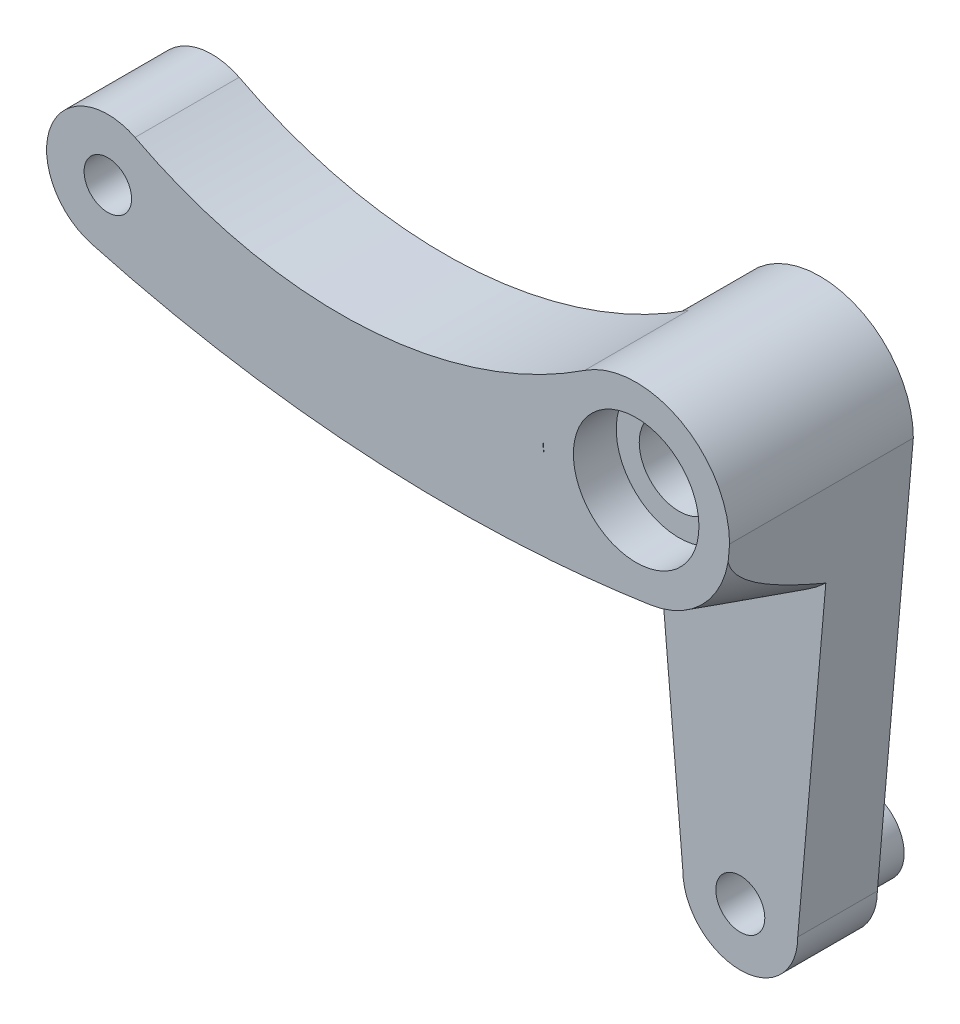
ISO-10303-21;
HEADER;
FILE_DESCRIPTION(('STEP AP214'),'2;1');
FILE_NAME('part.step','',(''),(''),'','','');
FILE_SCHEMA(('AUTOMOTIVE_DESIGN { 1 0 10303 214 1 1 1 1 }'));
ENDSEC;
DATA;
#1=APPLICATION_CONTEXT('core data for automotive mechanical design processes');
#2=APPLICATION_PROTOCOL_DEFINITION('international standard','automotive_design',2000,#1);
#3=PRODUCT_CONTEXT('',#1,'mechanical');
#4=PRODUCT('Part','Part','',(#3));
#5=PRODUCT_RELATED_PRODUCT_CATEGORY('part','',(#4));
#6=PRODUCT_DEFINITION_FORMATION('','',#4);
#7=PRODUCT_DEFINITION_CONTEXT('part definition',#1,'design');
#8=PRODUCT_DEFINITION('design','',#6,#7);
#9=PRODUCT_DEFINITION_SHAPE('','',#8);
#10=(LENGTH_UNIT() NAMED_UNIT(*) SI_UNIT(.MILLI.,.METRE.));
#11=(NAMED_UNIT(*) PLANE_ANGLE_UNIT() SI_UNIT($,.RADIAN.));
#12=(NAMED_UNIT(*) SI_UNIT($,.STERADIAN.) SOLID_ANGLE_UNIT());
#13=UNCERTAINTY_MEASURE_WITH_UNIT(LENGTH_MEASURE(1.E-05),#10,'distance_accuracy_value','');
#14=(GEOMETRIC_REPRESENTATION_CONTEXT(3) GLOBAL_UNCERTAINTY_ASSIGNED_CONTEXT((#13)) GLOBAL_UNIT_ASSIGNED_CONTEXT((#10,
#11,#12)) REPRESENTATION_CONTEXT('',''));
#15=CARTESIAN_POINT('',(0.,0.,0.));
#16=DIRECTION('',(0.,0.,1.));
#17=DIRECTION('',(1.,0.,0.));
#18=AXIS2_PLACEMENT_3D('',#15,#16,#17);
#19=CARTESIAN_POINT('',(0.,0.,12.));
#20=DIRECTION('',(0.,0.,-1.));
#21=DIRECTION('',(-1.,0.,0.));
#22=AXIS2_PLACEMENT_3D('',#19,#20,#21);
#23=CYLINDRICAL_SURFACE('',#22,6.1);
#24=CARTESIAN_POINT('',(0.,0.,5.2));
#25=DIRECTION('',(0.,0.,-1.));
#26=DIRECTION('',(1.,0.,0.));
#27=AXIS2_PLACEMENT_3D('',#24,#25,#26);
#28=CIRCLE('',#27,6.1);
#29=CARTESIAN_POINT('',(-6.1,0.,5.2));
#30=VERTEX_POINT('',#29);
#31=CARTESIAN_POINT('',(-3.36501602680877,5.08789417532638,5.2));
#32=VERTEX_POINT('',#31);
#33=EDGE_CURVE('E280',#30,#32,#28,.T.);
#34=ORIENTED_EDGE('',*,*,#33,.T.);
#35=DIRECTION('',(0.,0.,-1.));
#36=VECTOR('',#35,1.);
#37=CARTESIAN_POINT('',(-3.36501602680877,5.08789417532638,12.));
#38=LINE('',#37,#36);
#39=CARTESIAN_POINT('',(-3.36501602680877,5.08789417532638,12.));
#40=VERTEX_POINT('',#39);
#41=EDGE_CURVE('E154',#40,#32,#38,.T.);
#42=ORIENTED_EDGE('',*,*,#41,.F.);
#43=CARTESIAN_POINT('',(0.,0.,12.));
#44=DIRECTION('',(0.,0.,1.));
#45=DIRECTION('',(1.,0.,0.));
#46=AXIS2_PLACEMENT_3D('',#43,#44,#45);
#47=CIRCLE('',#46,6.1);
#48=CARTESIAN_POINT('',(6.1,0.,12.));
#49=VERTEX_POINT('',#48);
#50=EDGE_CURVE('E141',#49,#40,#47,.T.);
#51=ORIENTED_EDGE('',*,*,#50,.F.);
#52=DIRECTION('',(0.,0.,-1.));
#53=VECTOR('',#52,1.);
#54=CARTESIAN_POINT('',(6.1,0.,12.));
#55=LINE('',#54,#53);
#56=CARTESIAN_POINT('',(6.1,0.,0.));
#57=VERTEX_POINT('',#56);
#58=EDGE_CURVE('E215',#49,#57,#55,.T.);
#59=ORIENTED_EDGE('',*,*,#58,.T.);
#60=CARTESIAN_POINT('',(0.,0.,0.));
#61=DIRECTION('',(0.,0.,1.));
#62=DIRECTION('',(1.,0.,0.));
#63=AXIS2_PLACEMENT_3D('',#60,#61,#62);
#64=CIRCLE('',#63,6.1);
#65=CARTESIAN_POINT('',(-6.1,0.,0.));
#66=VERTEX_POINT('',#65);
#67=EDGE_CURVE('E205',#57,#66,#64,.T.);
#68=ORIENTED_EDGE('',*,*,#67,.T.);
#69=DIRECTION('',(0.,0.,-1.));
#70=VECTOR('',#69,1.);
#71=CARTESIAN_POINT('',(-6.1,0.,12.));
#72=LINE('',#71,#70);
#73=EDGE_CURVE('E211',#30,#66,#72,.T.);
#74=ORIENTED_EDGE('',*,*,#73,.F.);
#75=EDGE_LOOP('',(#34,#42,#51,#59,#68,#74));
#76=FACE_BOUND('',#75,.T.);
#77=ADVANCED_FACE('F35',(#76),#23,.T.);
#78=CARTESIAN_POINT('',(0.,0.,5.2));
#79=DIRECTION('',(0.,0.,1.));
#80=DIRECTION('',(1.,0.,0.));
#81=AXIS2_PLACEMENT_3D('',#78,#79,#80);
#82=PLANE('',#81);
#83=CARTESIAN_POINT('',(0.,-26.8,5.2));
#84=DIRECTION('',(0.,0.,1.));
#85=DIRECTION('',(1.,0.,0.));
#86=AXIS2_PLACEMENT_3D('',#83,#84,#85);
#87=CIRCLE('',#86,1.6);
#88=CARTESIAN_POINT('',(1.6,-26.8,5.2));
#89=VERTEX_POINT('',#88);
#90=EDGE_CURVE('E191',#89,#89,#87,.T.);
#91=ORIENTED_EDGE('',*,*,#90,.F.);
#92=EDGE_LOOP('',(#91));
#93=FACE_BOUND('',#92,.T.);
#94=CARTESIAN_POINT('',(0.,0.,5.2));
#95=DIRECTION('',(0.,0.,1.));
#96=DIRECTION('',(1.,0.,0.));
#97=AXIS2_PLACEMENT_3D('',#94,#95,#96);
#98=CIRCLE('',#97,8.1);
#99=CARTESIAN_POINT('',(5.58562427825305,-5.86607206077372,5.2));
#100=VERTEX_POINT('',#99);
#101=CARTESIAN_POINT('',(1.19677567262764,-8.01110029829902,5.2));
#102=VERTEX_POINT('',#101);
#103=EDGE_CURVE('E230',#100,#102,#98,.F.);
#104=ORIENTED_EDGE('',*,*,#103,.T.);
#105=CARTESIAN_POINT('',(-12.1716520767408,81.4758586867667,5.2));
#106=DIRECTION('',(0.,0.,1.));
#107=DIRECTION('',(1.,0.,0.));
#108=AXIS2_PLACEMENT_3D('',#105,#106,#107);
#109=CIRCLE('',#108,90.4800015964021);
#110=CARTESIAN_POINT('',(-5.33315072148599,-8.74534496347895,5.2));
#111=VERTEX_POINT('',#110);
#112=EDGE_CURVE('E232',#102,#111,#109,.F.);
#113=ORIENTED_EDGE('',*,*,#112,.T.);
#114=DIRECTION('',(0.0873513906763995,-0.996177561756386,0.));
#115=VECTOR('',#114,1.);
#116=CARTESIAN_POINT('',(-6.00691076147216,-1.06161344363656,5.2));
#117=LINE('',#116,#115);
#118=CARTESIAN_POINT('',(-3.75,-26.8,5.2));
#119=VERTEX_POINT('',#118);
#120=EDGE_CURVE('E180',#111,#119,#117,.T.);
#121=ORIENTED_EDGE('',*,*,#120,.T.);
#122=CARTESIAN_POINT('',(0.,-26.8,5.2));
#123=DIRECTION('',(0.,0.,1.));
#124=DIRECTION('',(1.,0.,0.));
#125=AXIS2_PLACEMENT_3D('',#122,#123,#124);
#126=CIRCLE('',#125,3.75);
#127=CARTESIAN_POINT('',(3.75,-26.8,5.2));
#128=VERTEX_POINT('',#127);
#129=EDGE_CURVE('E179',#119,#128,#126,.T.);
#130=ORIENTED_EDGE('',*,*,#129,.T.);
#131=DIRECTION('',(0.0873513906763995,0.996177561756386,0.));
#132=VECTOR('',#131,1.);
#133=CARTESIAN_POINT('',(3.75,-26.8,5.2));
#134=LINE('',#133,#132);
#135=EDGE_CURVE('E182',#128,#100,#134,.T.);
#136=ORIENTED_EDGE('',*,*,#135,.T.);
#137=EDGE_LOOP('',(#104,#113,#121,#130,#136));
#138=FACE_BOUND('',#137,.T.);
#139=ADVANCED_FACE('F269',(#93,#138),#82,.T.);
#140=CARTESIAN_POINT('',(0.,0.,12.));
#141=DIRECTION('',(0.,0.,-1.));
#142=DIRECTION('',(-1.,0.,0.));
#143=AXIS2_PLACEMENT_3D('',#140,#141,#142);
#144=CYLINDRICAL_SURFACE('',#143,2.6);
#145=CARTESIAN_POINT('',(0.,0.,2.8));
#146=DIRECTION('',(0.,0.,-1.));
#147=DIRECTION('',(-1.,0.,0.));
#148=AXIS2_PLACEMENT_3D('',#145,#146,#147);
#149=CIRCLE('',#148,2.6);
#150=CARTESIAN_POINT('',(-2.6,0.,2.8));
#151=VERTEX_POINT('',#150);
#152=EDGE_CURVE('E173',#151,#151,#149,.T.);
#153=ORIENTED_EDGE('',*,*,#152,.T.);
#154=EDGE_LOOP('',(#153));
#155=FACE_BOUND('',#154,.T.);
#156=CARTESIAN_POINT('',(0.,0.,9.2));
#157=DIRECTION('',(0.,0.,1.));
#158=DIRECTION('',(1.,0.,0.));
#159=AXIS2_PLACEMENT_3D('',#156,#157,#158);
#160=CIRCLE('',#159,2.6);
#161=CARTESIAN_POINT('',(2.6,0.,9.2));
#162=VERTEX_POINT('',#161);
#163=EDGE_CURVE('E149',#162,#162,#160,.T.);
#164=ORIENTED_EDGE('',*,*,#163,.T.);
#165=EDGE_LOOP('',(#164));
#166=FACE_BOUND('',#165,.T.);
#167=ADVANCED_FACE('F274',(#155,#166),#144,.F.);
#168=CARTESIAN_POINT('',(0.,-26.8,0.));
#169=DIRECTION('',(0.,0.,1.));
#170=DIRECTION('',(1.,0.,0.));
#171=AXIS2_PLACEMENT_3D('',#168,#169,#170);
#172=PLANE('',#171);
#173=CARTESIAN_POINT('',(0.,-26.8,0.));
#174=DIRECTION('',(0.,0.,1.));
#175=DIRECTION('',(1.,0.,0.));
#176=AXIS2_PLACEMENT_3D('',#173,#174,#175);
#177=CIRCLE('',#176,3.);
#178=CARTESIAN_POINT('',(3.,-26.8,0.));
#179=VERTEX_POINT('',#178);
#180=EDGE_CURVE('E227',#179,#179,#177,.T.);
#181=ORIENTED_EDGE('',*,*,#180,.T.);
#182=EDGE_LOOP('',(#181));
#183=FACE_BOUND('',#182,.T.);
#184=CARTESIAN_POINT('',(0.,-26.8,0.));
#185=DIRECTION('',(0.,0.,1.));
#186=DIRECTION('',(1.,0.,0.));
#187=AXIS2_PLACEMENT_3D('',#184,#185,#186);
#188=CIRCLE('',#187,3.75);
#189=CARTESIAN_POINT('',(-3.75,-26.8,0.));
#190=VERTEX_POINT('',#189);
#191=CARTESIAN_POINT('',(3.75,-26.8,0.));
#192=VERTEX_POINT('',#191);
#193=EDGE_CURVE('E200',#190,#192,#188,.T.);
#194=ORIENTED_EDGE('',*,*,#193,.F.);
#195=DIRECTION('',(0.0873513906763996,-0.996177561756386,0.));
#196=VECTOR('',#195,1.);
#197=CARTESIAN_POINT('',(-3.75,-26.8,0.));
#198=LINE('',#197,#196);
#199=EDGE_CURVE('E194',#66,#190,#198,.T.);
#200=ORIENTED_EDGE('',*,*,#199,.F.);
#201=ORIENTED_EDGE('',*,*,#67,.F.);
#202=DIRECTION('',(0.0873513906763996,0.996177561756386,0.));
#203=VECTOR('',#202,1.);
#204=CARTESIAN_POINT('',(6.1,0.,0.));
#205=LINE('',#204,#203);
#206=EDGE_CURVE('E203',#192,#57,#205,.T.);
#207=ORIENTED_EDGE('',*,*,#206,.F.);
#208=EDGE_LOOP('',(#194,#200,#201,#207));
#209=FACE_BOUND('',#208,.T.);
#210=CARTESIAN_POINT('',(0.,0.,0.));
#211=DIRECTION('',(0.,0.,-1.));
#212=DIRECTION('',(-1.,0.,0.));
#213=AXIS2_PLACEMENT_3D('',#210,#211,#212);
#214=CIRCLE('',#213,4.1);
#215=CARTESIAN_POINT('',(-4.1,0.,0.));
#216=VERTEX_POINT('',#215);
#217=EDGE_CURVE('E169',#216,#216,#214,.T.);
#218=ORIENTED_EDGE('',*,*,#217,.F.);
#219=EDGE_LOOP('',(#218));
#220=FACE_BOUND('',#219,.T.);
#221=ADVANCED_FACE('F262',(#183,#209,#220),#172,.F.);
#222=CARTESIAN_POINT('',(0.,-26.8,12.));
#223=DIRECTION('',(0.,0.,-1.));
#224=DIRECTION('',(-1.,0.,0.));
#225=AXIS2_PLACEMENT_3D('',#222,#223,#224);
#226=CYLINDRICAL_SURFACE('',#225,3.75);
#227=ORIENTED_EDGE('',*,*,#129,.F.);
#228=DIRECTION('',(0.,0.,-1.));
#229=VECTOR('',#228,1.);
#230=CARTESIAN_POINT('',(-3.75,-26.8,12.));
#231=LINE('',#230,#229);
#232=EDGE_CURVE('E199',#119,#190,#231,.T.);
#233=ORIENTED_EDGE('',*,*,#232,.T.);
#234=ORIENTED_EDGE('',*,*,#193,.T.);
#235=DIRECTION('',(0.,0.,-1.));
#236=VECTOR('',#235,1.);
#237=CARTESIAN_POINT('',(3.75,-26.8,12.));
#238=LINE('',#237,#236);
#239=EDGE_CURVE('E218',#128,#192,#238,.T.);
#240=ORIENTED_EDGE('',*,*,#239,.F.);
#241=EDGE_LOOP('',(#227,#233,#234,#240));
#242=FACE_BOUND('',#241,.T.);
#243=ADVANCED_FACE('F259',(#242),#226,.T.);
#244=CARTESIAN_POINT('',(0.,-26.8,12.));
#245=DIRECTION('',(0.,0.,-1.));
#246=DIRECTION('',(-1.,0.,0.));
#247=AXIS2_PLACEMENT_3D('',#244,#245,#246);
#248=CYLINDRICAL_SURFACE('',#247,1.6);
#249=ORIENTED_EDGE('',*,*,#90,.T.);
#250=EDGE_LOOP('',(#249));
#251=FACE_BOUND('',#250,.T.);
#252=CARTESIAN_POINT('',(0.,-26.8,-3.));
#253=DIRECTION('',(0.,0.,-1.));
#254=DIRECTION('',(-1.,0.,0.));
#255=AXIS2_PLACEMENT_3D('',#252,#253,#254);
#256=CIRCLE('',#255,1.6);
#257=CARTESIAN_POINT('',(-1.6,-26.8,-3.));
#258=VERTEX_POINT('',#257);
#259=EDGE_CURVE('E161',#258,#258,#256,.T.);
#260=ORIENTED_EDGE('',*,*,#259,.T.);
#261=EDGE_LOOP('',(#260));
#262=FACE_BOUND('',#261,.T.);
#263=ADVANCED_FACE('F261',(#251,#262),#248,.F.);
#264=CARTESIAN_POINT('',(0.,-26.8,12.));
#265=DIRECTION('',(0.,0.,1.));
#266=DIRECTION('',(1.,0.,0.));
#267=AXIS2_PLACEMENT_3D('',#264,#265,#266);
#268=PLANE('',#267);
#269=ORIENTED_EDGE('',*,*,#50,.T.);
#270=CARTESIAN_POINT('',(-19.3185063382412,29.2095238451383,12.));
#271=DIRECTION('',(0.,0.,-1.));
#272=DIRECTION('',(1.,0.,0.));
#273=AXIS2_PLACEMENT_3D('',#270,#271,#272);
#274=CIRCLE('',#273,28.9200081439221);
#275=CARTESIAN_POINT('',(-32.7223042418856,3.58326635788941,12.));
#276=VERTEX_POINT('',#275);
#277=EDGE_CURVE('E135',#40,#276,#274,.T.);
#278=ORIENTED_EDGE('',*,*,#277,.T.);
#279=CARTESIAN_POINT('',(-34.5,0.,12.));
#280=DIRECTION('',(0.,0.,1.));
#281=DIRECTION('',(1.,0.,0.));
#282=AXIS2_PLACEMENT_3D('',#279,#280,#281);
#283=CIRCLE('',#282,4.);
#284=CARTESIAN_POINT('',(-35.5572134233582,-3.85775838764835,12.));
#285=VERTEX_POINT('',#284);
#286=EDGE_CURVE('E123',#276,#285,#283,.T.);
#287=ORIENTED_EDGE('',*,*,#286,.T.);
#288=CARTESIAN_POINT('',(-12.1716520767408,81.4758586867667,12.));
#289=DIRECTION('',(0.,0.,1.));
#290=DIRECTION('',(1.,0.,0.));
#291=AXIS2_PLACEMENT_3D('',#288,#289,#290);
#292=CIRCLE('',#291,88.480001596402);
#293=CARTESIAN_POINT('',(-5.50786596339798,-6.7528477365677,12.));
#294=VERTEX_POINT('',#293);
#295=EDGE_CURVE('E290',#285,#294,#292,.T.);
#296=ORIENTED_EDGE('',*,*,#295,.T.);
#297=CARTESIAN_POINT('',(0.901275506546741,-6.03305084192889,12.));
#298=VERTEX_POINT('',#297);
#299=EDGE_CURVE('E134',#294,#298,#292,.T.);
#300=ORIENTED_EDGE('',*,*,#299,.T.);
#301=CARTESIAN_POINT('',(0.,0.,12.));
#302=DIRECTION('',(0.,0.,-1.));
#303=DIRECTION('',(1.,0.,0.));
#304=AXIS2_PLACEMENT_3D('',#301,#302,#303);
#305=CIRCLE('',#304,6.1);
#306=CARTESIAN_POINT('',(6.00691076147217,-1.06161344363654,12.));
#307=VERTEX_POINT('',#306);
#308=EDGE_CURVE('E186',#307,#298,#305,.T.);
#309=ORIENTED_EDGE('',*,*,#308,.F.);
#310=DIRECTION('',(0.0873513906763996,0.996177561756386,0.));
#311=VECTOR('',#310,1.);
#312=CARTESIAN_POINT('',(6.1,0.,12.));
#313=LINE('',#312,#311);
#314=EDGE_CURVE('E192',#307,#49,#313,.T.);
#315=ORIENTED_EDGE('',*,*,#314,.T.);
#316=EDGE_LOOP('',(#269,#278,#287,#296,#300,#309,#315));
#317=FACE_BOUND('',#316,.T.);
#318=CARTESIAN_POINT('',(0.,0.,12.));
#319=DIRECTION('',(0.,0.,1.));
#320=DIRECTION('',(1.,0.,0.));
#321=AXIS2_PLACEMENT_3D('',#318,#319,#320);
#322=CIRCLE('',#321,4.1);
#323=CARTESIAN_POINT('',(4.1,0.,12.));
#324=VERTEX_POINT('',#323);
#325=EDGE_CURVE('E152',#324,#324,#322,.T.);
#326=ORIENTED_EDGE('',*,*,#325,.F.);
#327=EDGE_LOOP('',(#326));
#328=FACE_BOUND('',#327,.T.);
#329=CARTESIAN_POINT('',(0.,0.,12.));
#330=DIRECTION('',(0.,0.,-1.));
#331=DIRECTION('',(1.,0.,0.));
#332=AXIS2_PLACEMENT_3D('',#329,#330,#331);
#333=CIRCLE('',#332,6.1);
#334=CARTESIAN_POINT('',(-6.00691076147217,-1.06161344363656,12.));
#335=VERTEX_POINT('',#334);
#336=CARTESIAN_POINT('',(-6.1,0.,12.));
#337=VERTEX_POINT('',#336);
#338=EDGE_CURVE('E288',#335,#337,#333,.T.);
#339=ORIENTED_EDGE('',*,*,#338,.T.);
#340=DIRECTION('',(0.0873513906763996,-0.996177561756386,0.));
#341=VECTOR('',#340,1.);
#342=CARTESIAN_POINT('',(-3.75,-26.8,12.));
#343=LINE('',#342,#341);
#344=EDGE_CURVE('E196',#337,#335,#343,.T.);
#345=ORIENTED_EDGE('',*,*,#344,.T.);
#346=EDGE_LOOP('',(#339,#345));
#347=FACE_BOUND('',#346,.T.);
#348=CARTESIAN_POINT('',(-34.5,0.,12.));
#349=DIRECTION('',(0.,0.,1.));
#350=DIRECTION('',(1.,0.,0.));
#351=AXIS2_PLACEMENT_3D('',#348,#349,#350);
#352=CIRCLE('',#351,1.55);
#353=CARTESIAN_POINT('',(-32.95,0.,12.));
#354=VERTEX_POINT('',#353);
#355=EDGE_CURVE('E296',#354,#354,#352,.T.);
#356=ORIENTED_EDGE('',*,*,#355,.F.);
#357=EDGE_LOOP('',(#356));
#358=FACE_BOUND('',#357,.T.);
#359=ADVANCED_FACE('F138',(#317,#328,#347,#358),#268,.T.);
#360=CARTESIAN_POINT('',(6.1,0.,12.));
#361=DIRECTION('',(-0.996177561756386,0.0873513906763996,0.));
#362=DIRECTION('',(-0.0873513906763996,-0.996177561756386,0.));
#363=AXIS2_PLACEMENT_3D('',#360,#361,#362);
#364=PLANE('',#363);
#365=ORIENTED_EDGE('',*,*,#314,.F.);
#366=CARTESIAN_POINT('',(6.00691076147217,-1.06161344363654,12.));
#367=CARTESIAN_POINT('',(5.99959290657591,-1.14506812926192,11.9751362120786));
#368=CARTESIAN_POINT('',(5.99243235980993,-1.22672883280593,11.9449550579356));
#369=CARTESIAN_POINT('',(5.97847258999629,-1.38592961195723,11.875879947173));
#370=CARTESIAN_POINT('',(5.9716719683851,-1.4634856371401,11.8370233346674));
#371=CARTESIAN_POINT('',(5.9520605990004,-1.68713870076144,11.7116434654856));
#372=CARTESIAN_POINT('',(5.93974067235911,-1.8276382896918,11.6151440803785));
#373=CARTESIAN_POINT('',(5.91544789226449,-2.10467935630285,11.3977095441893));
#374=CARTESIAN_POINT('',(5.90356521581586,-2.2401924323979,11.2755087663684));
#375=CARTESIAN_POINT('',(5.88086373731854,-2.49908588930343,11.018665461085));
#376=CARTESIAN_POINT('',(5.87004637830578,-2.62244981336389,10.8840065241382));
#377=CARTESIAN_POINT('',(5.84895494164729,-2.86298194206493,10.6024445651833));
#378=CARTESIAN_POINT('',(5.83870594811579,-2.97986408106249,10.455298842726));
#379=CARTESIAN_POINT('',(5.81891825837843,-3.2055279470034,10.1550985524621));
#380=CARTESIAN_POINT('',(5.80937907159271,-3.31431526864485,10.0020481788367));
#381=CARTESIAN_POINT('',(5.7887895818787,-3.54912306623438,9.65686973716212));
#382=CARTESIAN_POINT('',(5.77787859154305,-3.67355478580691,9.46365880553215));
#383=CARTESIAN_POINT('',(5.75670729540617,-3.91499765238915,9.07259651436457));
#384=CARTESIAN_POINT('',(5.74644714893255,-4.03200698238626,8.87474403468251));
#385=CARTESIAN_POINT('',(5.72643438988905,-4.2602375961589,8.47533693525285));
#386=CARTESIAN_POINT('',(5.71668253596197,-4.3714502281784,8.27377735671169));
#387=CARTESIAN_POINT('',(5.69760506355262,-4.58901459437862,7.86802950031076));
#388=CARTESIAN_POINT('',(5.68827946630312,-4.69536608641545,7.66384109215122));
#389=CARTESIAN_POINT('',(5.6708452773313,-4.89419002873236,7.27275622565571));
#390=CARTESIAN_POINT('',(5.66270485526182,-4.98702548041842,7.08604509495851));
#391=CARTESIAN_POINT('',(5.64667240975651,-5.16986358235133,6.71122496150828));
#392=CARTESIAN_POINT('',(5.63878039452783,-5.25986613900172,6.52311591282251));
#393=CARTESIAN_POINT('',(5.62323767587374,-5.43711927088676,6.14638500444437));
#394=CARTESIAN_POINT('',(5.61558623934931,-5.52437820656962,5.95776709992487));
#395=CARTESIAN_POINT('',(5.60047114905192,-5.69675455549298,5.57956788235996));
#396=CARTESIAN_POINT('',(5.59300747820271,-5.78187216347542,5.38998665882175));
#397=CARTESIAN_POINT('',(5.58562427825302,-5.86607206077408,5.20000000000024));
#398=B_SPLINE_CURVE_WITH_KNOTS('',3,(#366,#367,#368,#369,#370,#371,#372,#373,#374,#375,#376,
#377,#378,#379,#380,#381,#382,#383,#384,#385,#386,#387,#388,#389,#390,#391,#392,#393,#394,#395,
#396,#397),.UNSPECIFIED.,.F.,.F.,(4,2,2,2,2,2,2,2,2,2,2,2,2,2,2,4),(0.,0.261662991599172,
0.522220638804977,1.03265787208609,1.58016338965039,2.12840061963555,2.69264497011371,
3.25649565177873,3.9464781448824,4.63662890007616,5.32778184670861,6.01896918372801,
6.64497054759166,7.27099257234823,7.894873198066,8.51869687865698),.UNSPECIFIED.);
#399=EDGE_CURVE('E11',#307,#100,#398,.T.);
#400=ORIENTED_EDGE('',*,*,#399,.T.);
#401=ORIENTED_EDGE('',*,*,#135,.F.);
#402=ORIENTED_EDGE('',*,*,#239,.T.);
#403=ORIENTED_EDGE('',*,*,#206,.T.);
#404=ORIENTED_EDGE('',*,*,#58,.F.);
#405=EDGE_LOOP('',(#365,#400,#401,#402,#403,#404));
#406=FACE_BOUND('',#405,.T.);
#407=ADVANCED_FACE('F264',(#406),#364,.F.);
#408=CARTESIAN_POINT('',(-3.75,-26.8,12.));
#409=DIRECTION('',(0.996177561756386,0.0873513906763996,0.));
#410=DIRECTION('',(-0.0873513906763996,0.996177561756386,0.));
#411=AXIS2_PLACEMENT_3D('',#408,#409,#410);
#412=PLANE('',#411);
#413=CARTESIAN_POINT('',(-6.00691076147217,-1.06161344363654,5.2));
#414=VERTEX_POINT('',#413);
#415=CARTESIAN_POINT('',(-5.50786596339798,-6.75284773656769,5.2));
#416=VERTEX_POINT('',#415);
#417=EDGE_CURVE('E176',#414,#416,#117,.T.);
#418=ORIENTED_EDGE('',*,*,#417,.F.);
#419=DIRECTION('',(0.,0.,1.));
#420=VECTOR('',#419,1.);
#421=CARTESIAN_POINT('',(-6.00691076147216,-1.06161344363656,5.2));
#422=LINE('',#421,#420);
#423=EDGE_CURVE('E185',#414,#335,#422,.T.);
#424=ORIENTED_EDGE('',*,*,#423,.T.);
#425=ORIENTED_EDGE('',*,*,#344,.F.);
#426=EDGE_CURVE('E212',#337,#30,#72,.T.);
#427=ORIENTED_EDGE('',*,*,#426,.T.);
#428=ORIENTED_EDGE('',*,*,#73,.T.);
#429=ORIENTED_EDGE('',*,*,#199,.T.);
#430=ORIENTED_EDGE('',*,*,#232,.F.);
#431=ORIENTED_EDGE('',*,*,#120,.F.);
#432=CARTESIAN_POINT('',(-5.33315072148599,-8.74534496347895,5.2));
#433=CARTESIAN_POINT('',(-5.36226988574455,-8.41326257959401,6.33333347720731));
#434=CARTESIAN_POINT('',(-5.3913890713665,-8.0811799520756,7.46666688247763));
#435=CARTESIAN_POINT('',(-5.44962748533717,-7.41701420977185,9.7333335491443));
#436=CARTESIAN_POINT('',(-5.47874671368588,-7.08493109498651,10.8666668105406));
#437=CARTESIAN_POINT('',(-5.50786596339798,-6.7528477365677,12.));
#438=B_SPLINE_CURVE_WITH_KNOTS('',3,(#432,#433,#434,#435,#436,#437),.UNSPECIFIED.,.F.,.F.,(4,2,
4),(0.,3.54402915531912,7.08805831063824),.UNSPECIFIED.);
#439=EDGE_CURVE('E45',#111,#294,#438,.T.);
#440=ORIENTED_EDGE('',*,*,#439,.T.);
#441=DIRECTION('',(0.,0.,-1.));
#442=VECTOR('',#441,1.);
#443=CARTESIAN_POINT('',(-5.50786596339798,-6.75284773656769,5.2));
#444=LINE('',#443,#442);
#445=EDGE_CURVE('E52',#416,#294,#444,.F.);
#446=ORIENTED_EDGE('',*,*,#445,.F.);
#447=EDGE_LOOP('',(#418,#424,#425,#427,#428,#429,#430,#431,#440,#446));
#448=FACE_BOUND('',#447,.T.);
#449=ADVANCED_FACE('F244',(#448),#412,.F.);
#450=CARTESIAN_POINT('',(0.,0.,2.8));
#451=DIRECTION('',(0.,0.,-1.));
#452=DIRECTION('',(-1.,0.,0.));
#453=AXIS2_PLACEMENT_3D('',#450,#451,#452);
#454=CYLINDRICAL_SURFACE('',#453,4.1);
#455=CARTESIAN_POINT('',(0.,0.,2.8));
#456=DIRECTION('',(0.,0.,-1.));
#457=DIRECTION('',(-1.,0.,0.));
#458=AXIS2_PLACEMENT_3D('',#455,#456,#457);
#459=CIRCLE('',#458,4.1);
#460=CARTESIAN_POINT('',(-4.1,0.,2.8));
#461=VERTEX_POINT('',#460);
#462=EDGE_CURVE('E170',#461,#461,#459,.T.);
#463=ORIENTED_EDGE('',*,*,#462,.F.);
#464=EDGE_LOOP('',(#463));
#465=FACE_BOUND('',#464,.T.);
#466=ORIENTED_EDGE('',*,*,#217,.T.);
#467=EDGE_LOOP('',(#466));
#468=FACE_BOUND('',#467,.T.);
#469=ADVANCED_FACE('F364',(#465,#468),#454,.F.);
#470=CARTESIAN_POINT('',(0.,0.,2.8));
#471=DIRECTION('',(0.,0.,-1.));
#472=DIRECTION('',(-1.,0.,0.));
#473=AXIS2_PLACEMENT_3D('',#470,#471,#472);
#474=PLANE('',#473);
#475=ORIENTED_EDGE('',*,*,#152,.F.);
#476=EDGE_LOOP('',(#475));
#477=FACE_BOUND('',#476,.T.);
#478=ORIENTED_EDGE('',*,*,#462,.T.);
#479=EDGE_LOOP('',(#478));
#480=FACE_BOUND('',#479,.T.);
#481=ADVANCED_FACE('F357',(#477,#480),#474,.T.);
#482=CARTESIAN_POINT('',(0.,-26.8,-3.));
#483=DIRECTION('',(0.,0.,-1.));
#484=DIRECTION('',(-1.,0.,0.));
#485=AXIS2_PLACEMENT_3D('',#482,#483,#484);
#486=PLANE('',#485);
#487=CARTESIAN_POINT('',(0.,-26.8,-3.));
#488=DIRECTION('',(0.,0.,-1.));
#489=DIRECTION('',(-1.,0.,0.));
#490=AXIS2_PLACEMENT_3D('',#487,#488,#489);
#491=CIRCLE('',#490,2.5);
#492=CARTESIAN_POINT('',(-2.5,-26.8,-3.));
#493=VERTEX_POINT('',#492);
#494=EDGE_CURVE('E166',#493,#493,#491,.T.);
#495=ORIENTED_EDGE('',*,*,#494,.T.);
#496=EDGE_LOOP('',(#495));
#497=FACE_BOUND('',#496,.T.);
#498=ORIENTED_EDGE('',*,*,#259,.F.);
#499=EDGE_LOOP('',(#498));
#500=FACE_BOUND('',#499,.T.);
#501=ADVANCED_FACE('F354',(#497,#500),#486,.T.);
#502=CARTESIAN_POINT('',(0.,-26.8,-3.));
#503=DIRECTION('',(0.,0.,1.));
#504=DIRECTION('',(1.,0.,0.));
#505=AXIS2_PLACEMENT_3D('',#502,#503,#504);
#506=CYLINDRICAL_SURFACE('',#505,2.5);
#507=CARTESIAN_POINT('',(0.,-26.8,-0.499999999999999));
#508=DIRECTION('',(0.,0.,1.));
#509=DIRECTION('',(1.,0.,0.));
#510=AXIS2_PLACEMENT_3D('',#507,#508,#509);
#511=CIRCLE('',#510,2.5);
#512=CARTESIAN_POINT('',(2.5,-26.8,-0.499999999999999));
#513=VERTEX_POINT('',#512);
#514=EDGE_CURVE('E220',#513,#513,#511,.F.);
#515=ORIENTED_EDGE('',*,*,#514,.T.);
#516=EDGE_LOOP('',(#515));
#517=FACE_BOUND('',#516,.T.);
#518=ORIENTED_EDGE('',*,*,#494,.F.);
#519=EDGE_LOOP('',(#518));
#520=FACE_BOUND('',#519,.T.);
#521=ADVANCED_FACE('F257',(#517,#520),#506,.T.);
#522=CARTESIAN_POINT('',(0.,-26.8,-0.499999999999999));
#523=DIRECTION('',(0.,0.,1.));
#524=DIRECTION('',(1.,0.,0.));
#525=AXIS2_PLACEMENT_3D('',#522,#523,#524);
#526=CONICAL_SURFACE('',#525,2.5,0.785398163397448);
#527=ORIENTED_EDGE('',*,*,#180,.F.);
#528=EDGE_LOOP('',(#527));
#529=FACE_BOUND('',#528,.T.);
#530=ORIENTED_EDGE('',*,*,#514,.F.);
#531=EDGE_LOOP('',(#530));
#532=FACE_BOUND('',#531,.T.);
#533=ADVANCED_FACE('F253',(#529,#532),#526,.T.);
#534=CARTESIAN_POINT('',(0.,0.,9.2));
#535=DIRECTION('',(0.,0.,1.));
#536=DIRECTION('',(1.,0.,0.));
#537=AXIS2_PLACEMENT_3D('',#534,#535,#536);
#538=CYLINDRICAL_SURFACE('',#537,4.1);
#539=CARTESIAN_POINT('',(0.,0.,9.2));
#540=DIRECTION('',(0.,0.,1.));
#541=DIRECTION('',(1.,0.,0.));
#542=AXIS2_PLACEMENT_3D('',#539,#540,#541);
#543=CIRCLE('',#542,4.1);
#544=CARTESIAN_POINT('',(4.1,0.,9.2));
#545=VERTEX_POINT('',#544);
#546=EDGE_CURVE('E158',#545,#545,#543,.T.);
#547=ORIENTED_EDGE('',*,*,#546,.F.);
#548=EDGE_LOOP('',(#547));
#549=FACE_BOUND('',#548,.T.);
#550=ORIENTED_EDGE('',*,*,#325,.T.);
#551=EDGE_LOOP('',(#550));
#552=FACE_BOUND('',#551,.T.);
#553=ADVANCED_FACE('F256',(#549,#552),#538,.F.);
#554=CARTESIAN_POINT('',(0.,0.,9.2));
#555=DIRECTION('',(0.,0.,1.));
#556=DIRECTION('',(1.,0.,0.));
#557=AXIS2_PLACEMENT_3D('',#554,#555,#556);
#558=PLANE('',#557);
#559=ORIENTED_EDGE('',*,*,#163,.F.);
#560=EDGE_LOOP('',(#559));
#561=FACE_BOUND('',#560,.T.);
#562=ORIENTED_EDGE('',*,*,#546,.T.);
#563=EDGE_LOOP('',(#562));
#564=FACE_BOUND('',#563,.T.);
#565=ADVANCED_FACE('F339',(#561,#564),#558,.T.);
#566=CARTESIAN_POINT('',(-9.65925316912062,14.6047619225692,5.2));
#567=DIRECTION('',(0.,0.,1.));
#568=DIRECTION('',(1.,0.,0.));
#569=AXIS2_PLACEMENT_3D('',#566,#567,#568);
#570=PLANE('',#569);
#571=CARTESIAN_POINT('',(-34.5,0.,5.2));
#572=DIRECTION('',(0.,0.,1.));
#573=DIRECTION('',(1.,0.,0.));
#574=AXIS2_PLACEMENT_3D('',#571,#572,#573);
#575=CIRCLE('',#574,1.55);
#576=CARTESIAN_POINT('',(-32.95,0.,5.2));
#577=VERTEX_POINT('',#576);
#578=EDGE_CURVE('E308',#577,#577,#575,.T.);
#579=ORIENTED_EDGE('',*,*,#578,.T.);
#580=EDGE_LOOP('',(#579));
#581=FACE_BOUND('',#580,.T.);
#582=EDGE_CURVE('E144',#414,#30,#28,.T.);
#583=ORIENTED_EDGE('',*,*,#582,.F.);
#584=ORIENTED_EDGE('',*,*,#417,.T.);
#585=CARTESIAN_POINT('',(-12.1716520767408,81.4758586867667,5.2));
#586=DIRECTION('',(0.,0.,1.));
#587=DIRECTION('',(1.,0.,0.));
#588=AXIS2_PLACEMENT_3D('',#585,#586,#587);
#589=CIRCLE('',#588,88.480001596402);
#590=CARTESIAN_POINT('',(-35.5572134233582,-3.85775838764835,5.2));
#591=VERTEX_POINT('',#590);
#592=EDGE_CURVE('E283',#591,#416,#589,.T.);
#593=ORIENTED_EDGE('',*,*,#592,.F.);
#594=CARTESIAN_POINT('',(-34.5,0.,5.2));
#595=DIRECTION('',(0.,0.,1.));
#596=DIRECTION('',(1.,0.,0.));
#597=AXIS2_PLACEMENT_3D('',#594,#595,#596);
#598=CIRCLE('',#597,4.);
#599=CARTESIAN_POINT('',(-32.7223042418856,3.58326635788941,5.2));
#600=VERTEX_POINT('',#599);
#601=EDGE_CURVE('E285',#600,#591,#598,.T.);
#602=ORIENTED_EDGE('',*,*,#601,.F.);
#603=CARTESIAN_POINT('',(-19.3185063382412,29.2095238451383,5.2));
#604=DIRECTION('',(0.,0.,-1.));
#605=DIRECTION('',(1.,0.,0.));
#606=AXIS2_PLACEMENT_3D('',#603,#604,#605);
#607=CIRCLE('',#606,28.9200081439221);
#608=EDGE_CURVE('E148',#32,#600,#607,.T.);
#609=ORIENTED_EDGE('',*,*,#608,.F.);
#610=ORIENTED_EDGE('',*,*,#33,.F.);
#611=EDGE_LOOP('',(#583,#584,#593,#602,#609,#610));
#612=FACE_BOUND('',#611,.T.);
#613=ADVANCED_FACE('F300',(#581,#612),#570,.F.);
#614=CARTESIAN_POINT('',(0.,0.,12.));
#615=DIRECTION('',(0.,0.,-1.));
#616=DIRECTION('',(-1.,0.,0.));
#617=AXIS2_PLACEMENT_3D('',#614,#615,#616);
#618=CYLINDRICAL_SURFACE('',#617,6.1);
#619=ORIENTED_EDGE('',*,*,#338,.F.);
#620=ORIENTED_EDGE('',*,*,#423,.F.);
#621=ORIENTED_EDGE('',*,*,#582,.T.);
#622=ORIENTED_EDGE('',*,*,#426,.F.);
#623=EDGE_LOOP('',(#619,#620,#621,#622));
#624=FACE_BOUND('',#623,.T.);
#625=ADVANCED_FACE('F331',(#624),#618,.F.);
#626=CARTESIAN_POINT('',(-19.3185063382412,29.2095238451383,12.));
#627=DIRECTION('',(0.,0.,-1.));
#628=DIRECTION('',(-1.,0.,0.));
#629=AXIS2_PLACEMENT_3D('',#626,#627,#628);
#630=CYLINDRICAL_SURFACE('',#629,28.9200081439221);
#631=ORIENTED_EDGE('',*,*,#608,.T.);
#632=DIRECTION('',(0.,0.,-1.));
#633=VECTOR('',#632,1.);
#634=CARTESIAN_POINT('',(-32.7223042418856,3.58326635788941,12.));
#635=LINE('',#634,#633);
#636=EDGE_CURVE('E127',#276,#600,#635,.T.);
#637=ORIENTED_EDGE('',*,*,#636,.F.);
#638=ORIENTED_EDGE('',*,*,#277,.F.);
#639=ORIENTED_EDGE('',*,*,#41,.T.);
#640=EDGE_LOOP('',(#631,#637,#638,#639));
#641=FACE_BOUND('',#640,.T.);
#642=ADVANCED_FACE('F146',(#641),#630,.F.);
#643=CARTESIAN_POINT('',(-34.5,0.,12.));
#644=DIRECTION('',(0.,0.,-1.));
#645=DIRECTION('',(-1.,0.,0.));
#646=AXIS2_PLACEMENT_3D('',#643,#644,#645);
#647=CYLINDRICAL_SURFACE('',#646,4.);
#648=ORIENTED_EDGE('',*,*,#601,.T.);
#649=DIRECTION('',(0.,0.,-1.));
#650=VECTOR('',#649,1.);
#651=CARTESIAN_POINT('',(-35.5572134233582,-3.85775838764835,12.));
#652=LINE('',#651,#650);
#653=EDGE_CURVE('E130',#285,#591,#652,.T.);
#654=ORIENTED_EDGE('',*,*,#653,.F.);
#655=ORIENTED_EDGE('',*,*,#286,.F.);
#656=ORIENTED_EDGE('',*,*,#636,.T.);
#657=EDGE_LOOP('',(#648,#654,#655,#656));
#658=FACE_BOUND('',#657,.T.);
#659=ADVANCED_FACE('F125',(#658),#647,.T.);
#660=CARTESIAN_POINT('',(-12.1716520767408,81.4758586867667,12.));
#661=DIRECTION('',(0.,0.,-1.));
#662=DIRECTION('',(-1.,0.,0.));
#663=AXIS2_PLACEMENT_3D('',#660,#661,#662);
#664=CYLINDRICAL_SURFACE('',#663,88.480001596402);
#665=ORIENTED_EDGE('',*,*,#592,.T.);
#666=ORIENTED_EDGE('',*,*,#445,.T.);
#667=ORIENTED_EDGE('',*,*,#295,.F.);
#668=ORIENTED_EDGE('',*,*,#653,.T.);
#669=EDGE_LOOP('',(#665,#666,#667,#668));
#670=FACE_BOUND('',#669,.T.);
#671=ADVANCED_FACE('F299',(#670),#664,.T.);
#672=CARTESIAN_POINT('',(-34.5,0.,12.));
#673=DIRECTION('',(0.,0.,-1.));
#674=DIRECTION('',(-1.,0.,0.));
#675=AXIS2_PLACEMENT_3D('',#672,#673,#674);
#676=CYLINDRICAL_SURFACE('',#675,1.55);
#677=ORIENTED_EDGE('',*,*,#355,.T.);
#678=EDGE_LOOP('',(#677));
#679=FACE_BOUND('',#678,.T.);
#680=ORIENTED_EDGE('',*,*,#578,.F.);
#681=EDGE_LOOP('',(#680));
#682=FACE_BOUND('',#681,.T.);
#683=ADVANCED_FACE('F345',(#679,#682),#676,.F.);
#684=CARTESIAN_POINT('',(0.,0.,5.2));
#685=DIRECTION('',(0.,0.,-1.));
#686=DIRECTION('',(-1.,0.,0.));
#687=AXIS2_PLACEMENT_3D('',#684,#685,#686);
#688=CONICAL_SURFACE('',#687,8.1,0.286051441717318);
#689=ORIENTED_EDGE('',*,*,#399,.F.);
#690=ORIENTED_EDGE('',*,*,#308,.T.);
#691=DIRECTION('',(-0.0416900978009699,0.279069471888722,0.959365501571271));
#692=VECTOR('',#691,1.);
#693=CARTESIAN_POINT('',(1.19677567262764,-8.01110029829902,5.2));
#694=LINE('',#693,#692);
#695=EDGE_CURVE('E40',#102,#298,#694,.T.);
#696=ORIENTED_EDGE('',*,*,#695,.F.);
#697=ORIENTED_EDGE('',*,*,#103,.F.);
#698=EDGE_LOOP('',(#689,#690,#696,#697));
#699=FACE_BOUND('',#698,.T.);
#700=ADVANCED_FACE('F37',(#699),#688,.T.);
#701=CARTESIAN_POINT('',(-12.1716520767408,81.4758586867667,5.2));
#702=DIRECTION('',(0.,0.,-1.));
#703=DIRECTION('',(-1.,0.,0.));
#704=AXIS2_PLACEMENT_3D('',#701,#702,#703);
#705=CONICAL_SURFACE('',#704,90.480001596402,0.286051441717318);
#706=ORIENTED_EDGE('',*,*,#695,.T.);
#707=ORIENTED_EDGE('',*,*,#299,.F.);
#708=ORIENTED_EDGE('',*,*,#439,.F.);
#709=ORIENTED_EDGE('',*,*,#112,.F.);
#710=EDGE_LOOP('',(#706,#707,#708,#709));
#711=FACE_BOUND('',#710,.T.);
#712=ADVANCED_FACE('F248',(#711),#705,.T.);
#713=CLOSED_SHELL('',(#77,#139,#167,#221,#243,#263,#359,#407,#449,#469,#481,#501,#521,#533,#553,
#565,#613,#625,#642,#659,#671,#683,#700,#712));
#714=MANIFOLD_SOLID_BREP('B2',#713);
#715=ADVANCED_BREP_SHAPE_REPRESENTATION('',(#18,#714),#14);
#716=SHAPE_DEFINITION_REPRESENTATION(#9,#715);
ENDSEC;
END-ISO-10303-21;
